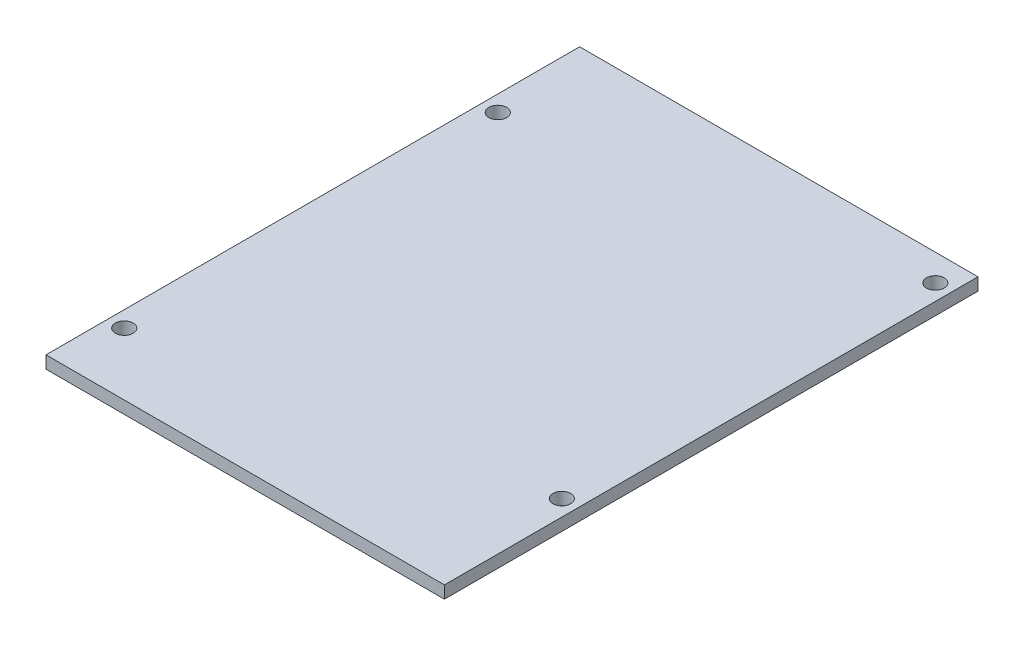
ISO-10303-21;
HEADER;
FILE_DESCRIPTION(('STEP AP214'),'2;1');
FILE_NAME('part.step','',(''),(''),'','','');
FILE_SCHEMA(('AUTOMOTIVE_DESIGN { 1 0 10303 214 1 1 1 1 }'));
ENDSEC;
DATA;
#1=APPLICATION_CONTEXT('core data for automotive mechanical design processes');
#2=APPLICATION_PROTOCOL_DEFINITION('international standard','automotive_design',2000,#1);
#3=PRODUCT_CONTEXT('',#1,'mechanical');
#4=PRODUCT('Part','Part','',(#3));
#5=PRODUCT_RELATED_PRODUCT_CATEGORY('part','',(#4));
#6=PRODUCT_DEFINITION_FORMATION('','',#4);
#7=PRODUCT_DEFINITION_CONTEXT('part definition',#1,'design');
#8=PRODUCT_DEFINITION('design','',#6,#7);
#9=PRODUCT_DEFINITION_SHAPE('','',#8);
#10=(LENGTH_UNIT() NAMED_UNIT(*) SI_UNIT(.MILLI.,.METRE.));
#11=(NAMED_UNIT(*) PLANE_ANGLE_UNIT() SI_UNIT($,.RADIAN.));
#12=(NAMED_UNIT(*) SI_UNIT($,.STERADIAN.) SOLID_ANGLE_UNIT());
#13=UNCERTAINTY_MEASURE_WITH_UNIT(LENGTH_MEASURE(1.E-05),#10,'distance_accuracy_value','');
#14=(GEOMETRIC_REPRESENTATION_CONTEXT(3) GLOBAL_UNCERTAINTY_ASSIGNED_CONTEXT((#13)) GLOBAL_UNIT_ASSIGNED_CONTEXT((#10,
#11,#12)) REPRESENTATION_CONTEXT('',''));
#15=CARTESIAN_POINT('',(0.,0.,0.));
#16=DIRECTION('',(0.,0.,1.));
#17=DIRECTION('',(1.,0.,0.));
#18=AXIS2_PLACEMENT_3D('',#15,#16,#17);
#19=CARTESIAN_POINT('',(-56.,3.5,75.));
#20=DIRECTION('',(1.,0.,0.));
#21=DIRECTION('',(0.,0.,-1.));
#22=AXIS2_PLACEMENT_3D('',#19,#20,#21);
#23=PLANE('',#22);
#24=DIRECTION('',(0.,0.,1.));
#25=VECTOR('',#24,1.);
#26=CARTESIAN_POINT('',(-56.,0.,75.));
#27=LINE('',#26,#25);
#28=CARTESIAN_POINT('',(-56.,0.,-75.));
#29=VERTEX_POINT('',#28);
#30=CARTESIAN_POINT('',(-56.,0.,75.));
#31=VERTEX_POINT('',#30);
#32=EDGE_CURVE('E96',#29,#31,#27,.T.);
#33=ORIENTED_EDGE('',*,*,#32,.T.);
#34=DIRECTION('',(0.,-1.,0.));
#35=VECTOR('',#34,1.);
#36=CARTESIAN_POINT('',(-56.,3.5,75.));
#37=LINE('',#36,#35);
#38=CARTESIAN_POINT('',(-56.,3.5,75.));
#39=VERTEX_POINT('',#38);
#40=EDGE_CURVE('E11',#39,#31,#37,.T.);
#41=ORIENTED_EDGE('',*,*,#40,.F.);
#42=DIRECTION('',(0.,0.,1.));
#43=VECTOR('',#42,1.);
#44=CARTESIAN_POINT('',(-56.,3.5,75.));
#45=LINE('',#44,#43);
#46=CARTESIAN_POINT('',(-56.,3.5,-75.));
#47=VERTEX_POINT('',#46);
#48=EDGE_CURVE('E84',#47,#39,#45,.T.);
#49=ORIENTED_EDGE('',*,*,#48,.F.);
#50=DIRECTION('',(0.,-1.,0.));
#51=VECTOR('',#50,1.);
#52=CARTESIAN_POINT('',(-56.,3.5,-75.));
#53=LINE('',#52,#51);
#54=EDGE_CURVE('E92',#47,#29,#53,.T.);
#55=ORIENTED_EDGE('',*,*,#54,.T.);
#56=EDGE_LOOP('',(#33,#41,#49,#55));
#57=FACE_BOUND('',#56,.T.);
#58=ADVANCED_FACE('F33',(#57),#23,.F.);
#59=CARTESIAN_POINT('',(-56.,3.5,75.));
#60=DIRECTION('',(0.,0.,-1.));
#61=DIRECTION('',(-1.,0.,0.));
#62=AXIS2_PLACEMENT_3D('',#59,#60,#61);
#63=PLANE('',#62);
#64=DIRECTION('',(1.,0.,0.));
#65=VECTOR('',#64,1.);
#66=CARTESIAN_POINT('',(-56.,0.,75.));
#67=LINE('',#66,#65);
#68=CARTESIAN_POINT('',(56.,0.,75.));
#69=VERTEX_POINT('',#68);
#70=EDGE_CURVE('E88',#31,#69,#67,.T.);
#71=ORIENTED_EDGE('',*,*,#70,.T.);
#72=DIRECTION('',(0.,-1.,0.));
#73=VECTOR('',#72,1.);
#74=CARTESIAN_POINT('',(56.,3.5,75.));
#75=LINE('',#74,#73);
#76=CARTESIAN_POINT('',(56.,3.5,75.));
#77=VERTEX_POINT('',#76);
#78=EDGE_CURVE('E41',#77,#69,#75,.T.);
#79=ORIENTED_EDGE('',*,*,#78,.F.);
#80=DIRECTION('',(1.,0.,0.));
#81=VECTOR('',#80,1.);
#82=CARTESIAN_POINT('',(-56.,3.5,75.));
#83=LINE('',#82,#81);
#84=EDGE_CURVE('E79',#39,#77,#83,.T.);
#85=ORIENTED_EDGE('',*,*,#84,.F.);
#86=ORIENTED_EDGE('',*,*,#40,.T.);
#87=EDGE_LOOP('',(#71,#79,#85,#86));
#88=FACE_BOUND('',#87,.T.);
#89=ADVANCED_FACE('F87',(#88),#63,.F.);
#90=CARTESIAN_POINT('',(56.,3.5,75.));
#91=DIRECTION('',(-1.,0.,0.));
#92=DIRECTION('',(0.,0.,1.));
#93=AXIS2_PLACEMENT_3D('',#90,#91,#92);
#94=PLANE('',#93);
#95=DIRECTION('',(0.,0.,-1.));
#96=VECTOR('',#95,1.);
#97=CARTESIAN_POINT('',(56.,0.,75.));
#98=LINE('',#97,#96);
#99=CARTESIAN_POINT('',(56.,0.,-75.));
#100=VERTEX_POINT('',#99);
#101=EDGE_CURVE('E66',#69,#100,#98,.T.);
#102=ORIENTED_EDGE('',*,*,#101,.T.);
#103=DIRECTION('',(0.,-1.,0.));
#104=VECTOR('',#103,1.);
#105=CARTESIAN_POINT('',(56.,3.5,-75.));
#106=LINE('',#105,#104);
#107=CARTESIAN_POINT('',(56.,3.5,-75.));
#108=VERTEX_POINT('',#107);
#109=EDGE_CURVE('E89',#108,#100,#106,.T.);
#110=ORIENTED_EDGE('',*,*,#109,.F.);
#111=DIRECTION('',(0.,0.,-1.));
#112=VECTOR('',#111,1.);
#113=CARTESIAN_POINT('',(56.,3.5,75.));
#114=LINE('',#113,#112);
#115=EDGE_CURVE('E82',#77,#108,#114,.T.);
#116=ORIENTED_EDGE('',*,*,#115,.F.);
#117=ORIENTED_EDGE('',*,*,#78,.T.);
#118=EDGE_LOOP('',(#102,#110,#116,#117));
#119=FACE_BOUND('',#118,.T.);
#120=ADVANCED_FACE('F90',(#119),#94,.F.);
#121=CARTESIAN_POINT('',(-56.,3.5,-75.));
#122=DIRECTION('',(0.,0.,1.));
#123=DIRECTION('',(1.,0.,0.));
#124=AXIS2_PLACEMENT_3D('',#121,#122,#123);
#125=PLANE('',#124);
#126=DIRECTION('',(-1.,0.,0.));
#127=VECTOR('',#126,1.);
#128=CARTESIAN_POINT('',(-56.,0.,-75.));
#129=LINE('',#128,#127);
#130=EDGE_CURVE('E72',#100,#29,#129,.T.);
#131=ORIENTED_EDGE('',*,*,#130,.T.);
#132=ORIENTED_EDGE('',*,*,#54,.F.);
#133=DIRECTION('',(-1.,0.,0.));
#134=VECTOR('',#133,1.);
#135=CARTESIAN_POINT('',(-56.,3.5,-75.));
#136=LINE('',#135,#134);
#137=EDGE_CURVE('E49',#108,#47,#136,.T.);
#138=ORIENTED_EDGE('',*,*,#137,.F.);
#139=ORIENTED_EDGE('',*,*,#109,.T.);
#140=EDGE_LOOP('',(#131,#132,#138,#139));
#141=FACE_BOUND('',#140,.T.);
#142=ADVANCED_FACE('F104',(#141),#125,.F.);
#143=CARTESIAN_POINT('',(0.,3.5,0.));
#144=DIRECTION('',(0.,-1.,0.));
#145=DIRECTION('',(0.,0.,-1.));
#146=AXIS2_PLACEMENT_3D('',#143,#144,#145);
#147=PLANE('',#146);
#148=CARTESIAN_POINT('',(51.4999999999999,3.5,-67.5));
#149=DIRECTION('',(0.,1.,0.));
#150=DIRECTION('',(0.,0.,1.));
#151=AXIS2_PLACEMENT_3D('',#148,#149,#150);
#152=CIRCLE('',#151,2.5);
#153=CARTESIAN_POINT('',(51.4999999999999,3.5,-65.));
#154=VERTEX_POINT('',#153);
#155=EDGE_CURVE('E99',#154,#154,#152,.T.);
#156=ORIENTED_EDGE('',*,*,#155,.F.);
#157=EDGE_LOOP('',(#156));
#158=FACE_BOUND('',#157,.T.);
#159=CARTESIAN_POINT('',(-51.5,3.5,-47.5));
#160=DIRECTION('',(0.,1.,0.));
#161=DIRECTION('',(0.,0.,1.));
#162=AXIS2_PLACEMENT_3D('',#159,#160,#161);
#163=CIRCLE('',#162,2.5);
#164=CARTESIAN_POINT('',(-51.5,3.5,-45.));
#165=VERTEX_POINT('',#164);
#166=EDGE_CURVE('E125',#165,#165,#163,.T.);
#167=ORIENTED_EDGE('',*,*,#166,.F.);
#168=EDGE_LOOP('',(#167));
#169=FACE_BOUND('',#168,.T.);
#170=CARTESIAN_POINT('',(51.5,3.5,37.5));
#171=DIRECTION('',(0.,1.,0.));
#172=DIRECTION('',(0.,0.,1.));
#173=AXIS2_PLACEMENT_3D('',#170,#171,#172);
#174=CIRCLE('',#173,2.5);
#175=CARTESIAN_POINT('',(51.5,3.5,40.));
#176=VERTEX_POINT('',#175);
#177=EDGE_CURVE('E119',#176,#176,#174,.T.);
#178=ORIENTED_EDGE('',*,*,#177,.F.);
#179=EDGE_LOOP('',(#178));
#180=FACE_BOUND('',#179,.T.);
#181=CARTESIAN_POINT('',(-51.5,3.5,57.5));
#182=DIRECTION('',(0.,1.,0.));
#183=DIRECTION('',(0.,0.,1.));
#184=AXIS2_PLACEMENT_3D('',#181,#182,#183);
#185=CIRCLE('',#184,2.5);
#186=CARTESIAN_POINT('',(-51.5,3.5,60.));
#187=VERTEX_POINT('',#186);
#188=EDGE_CURVE('E113',#187,#187,#185,.T.);
#189=ORIENTED_EDGE('',*,*,#188,.F.);
#190=EDGE_LOOP('',(#189));
#191=FACE_BOUND('',#190,.T.);
#192=ORIENTED_EDGE('',*,*,#48,.T.);
#193=ORIENTED_EDGE('',*,*,#84,.T.);
#194=ORIENTED_EDGE('',*,*,#115,.T.);
#195=ORIENTED_EDGE('',*,*,#137,.T.);
#196=EDGE_LOOP('',(#192,#193,#194,#195));
#197=FACE_BOUND('',#196,.T.);
#198=ADVANCED_FACE('F80',(#158,#169,#180,#191,#197),#147,.F.);
#199=CARTESIAN_POINT('',(0.,0.,0.));
#200=DIRECTION('',(0.,-1.,0.));
#201=DIRECTION('',(0.,0.,-1.));
#202=AXIS2_PLACEMENT_3D('',#199,#200,#201);
#203=PLANE('',#202);
#204=CARTESIAN_POINT('',(51.4999999999999,0.,-67.5));
#205=DIRECTION('',(0.,-1.,0.));
#206=DIRECTION('',(0.,0.,-1.));
#207=AXIS2_PLACEMENT_3D('',#204,#205,#206);
#208=CIRCLE('',#207,2.5);
#209=CARTESIAN_POINT('',(51.4999999999999,0.,-70.));
#210=VERTEX_POINT('',#209);
#211=EDGE_CURVE('E128',#210,#210,#208,.F.);
#212=ORIENTED_EDGE('',*,*,#211,.T.);
#213=EDGE_LOOP('',(#212));
#214=FACE_BOUND('',#213,.T.);
#215=CARTESIAN_POINT('',(-51.5,0.,-47.5));
#216=DIRECTION('',(0.,-1.,0.));
#217=DIRECTION('',(0.,0.,-1.));
#218=AXIS2_PLACEMENT_3D('',#215,#216,#217);
#219=CIRCLE('',#218,2.5);
#220=CARTESIAN_POINT('',(-51.5,0.,-50.));
#221=VERTEX_POINT('',#220);
#222=EDGE_CURVE('E122',#221,#221,#219,.F.);
#223=ORIENTED_EDGE('',*,*,#222,.T.);
#224=EDGE_LOOP('',(#223));
#225=FACE_BOUND('',#224,.T.);
#226=CARTESIAN_POINT('',(51.5,0.,37.5));
#227=DIRECTION('',(0.,-1.,0.));
#228=DIRECTION('',(0.,0.,-1.));
#229=AXIS2_PLACEMENT_3D('',#226,#227,#228);
#230=CIRCLE('',#229,2.5);
#231=CARTESIAN_POINT('',(51.5,0.,35.));
#232=VERTEX_POINT('',#231);
#233=EDGE_CURVE('E116',#232,#232,#230,.F.);
#234=ORIENTED_EDGE('',*,*,#233,.T.);
#235=EDGE_LOOP('',(#234));
#236=FACE_BOUND('',#235,.T.);
#237=CARTESIAN_POINT('',(-51.5,0.,57.5));
#238=DIRECTION('',(0.,-1.,0.));
#239=DIRECTION('',(0.,0.,-1.));
#240=AXIS2_PLACEMENT_3D('',#237,#238,#239);
#241=CIRCLE('',#240,2.5);
#242=CARTESIAN_POINT('',(-51.5,0.,55.));
#243=VERTEX_POINT('',#242);
#244=EDGE_CURVE('E110',#243,#243,#241,.F.);
#245=ORIENTED_EDGE('',*,*,#244,.T.);
#246=EDGE_LOOP('',(#245));
#247=FACE_BOUND('',#246,.T.);
#248=ORIENTED_EDGE('',*,*,#32,.F.);
#249=ORIENTED_EDGE('',*,*,#130,.F.);
#250=ORIENTED_EDGE('',*,*,#101,.F.);
#251=ORIENTED_EDGE('',*,*,#70,.F.);
#252=EDGE_LOOP('',(#248,#249,#250,#251));
#253=FACE_BOUND('',#252,.T.);
#254=ADVANCED_FACE('F107',(#214,#225,#236,#247,#253),#203,.T.);
#255=CARTESIAN_POINT('',(-51.5,-0.00100000000000013,57.5));
#256=DIRECTION('',(0.,1.,0.));
#257=DIRECTION('',(0.,0.,1.));
#258=AXIS2_PLACEMENT_3D('',#255,#256,#257);
#259=CYLINDRICAL_SURFACE('',#258,2.5);
#260=ORIENTED_EDGE('',*,*,#244,.F.);
#261=EDGE_LOOP('',(#260));
#262=FACE_BOUND('',#261,.T.);
#263=ORIENTED_EDGE('',*,*,#188,.T.);
#264=EDGE_LOOP('',(#263));
#265=FACE_BOUND('',#264,.T.);
#266=ADVANCED_FACE('F145',(#262,#265),#259,.F.);
#267=CARTESIAN_POINT('',(51.5,-0.00100000000000013,37.5));
#268=DIRECTION('',(0.,1.,0.));
#269=DIRECTION('',(0.,0.,1.));
#270=AXIS2_PLACEMENT_3D('',#267,#268,#269);
#271=CYLINDRICAL_SURFACE('',#270,2.5);
#272=ORIENTED_EDGE('',*,*,#233,.F.);
#273=EDGE_LOOP('',(#272));
#274=FACE_BOUND('',#273,.T.);
#275=ORIENTED_EDGE('',*,*,#177,.T.);
#276=EDGE_LOOP('',(#275));
#277=FACE_BOUND('',#276,.T.);
#278=ADVANCED_FACE('F147',(#274,#277),#271,.F.);
#279=CARTESIAN_POINT('',(-51.5,-0.00100000000000013,-47.5));
#280=DIRECTION('',(0.,1.,0.));
#281=DIRECTION('',(0.,0.,1.));
#282=AXIS2_PLACEMENT_3D('',#279,#280,#281);
#283=CYLINDRICAL_SURFACE('',#282,2.5);
#284=ORIENTED_EDGE('',*,*,#222,.F.);
#285=EDGE_LOOP('',(#284));
#286=FACE_BOUND('',#285,.T.);
#287=ORIENTED_EDGE('',*,*,#166,.T.);
#288=EDGE_LOOP('',(#287));
#289=FACE_BOUND('',#288,.T.);
#290=ADVANCED_FACE('F154',(#286,#289),#283,.F.);
#291=CARTESIAN_POINT('',(51.4999999999999,-0.00100000000000013,-67.5));
#292=DIRECTION('',(0.,1.,0.));
#293=DIRECTION('',(0.,0.,1.));
#294=AXIS2_PLACEMENT_3D('',#291,#292,#293);
#295=CYLINDRICAL_SURFACE('',#294,2.5);
#296=ORIENTED_EDGE('',*,*,#211,.F.);
#297=EDGE_LOOP('',(#296));
#298=FACE_BOUND('',#297,.T.);
#299=ORIENTED_EDGE('',*,*,#155,.T.);
#300=EDGE_LOOP('',(#299));
#301=FACE_BOUND('',#300,.T.);
#302=ADVANCED_FACE('F134',(#298,#301),#295,.F.);
#303=CLOSED_SHELL('',(#58,#89,#120,#142,#198,#254,#266,#278,#290,#302));
#304=MANIFOLD_SOLID_BREP('B2',#303);
#305=ADVANCED_BREP_SHAPE_REPRESENTATION('',(#18,#304),#14);
#306=SHAPE_DEFINITION_REPRESENTATION(#9,#305);
ENDSEC;
END-ISO-10303-21;
